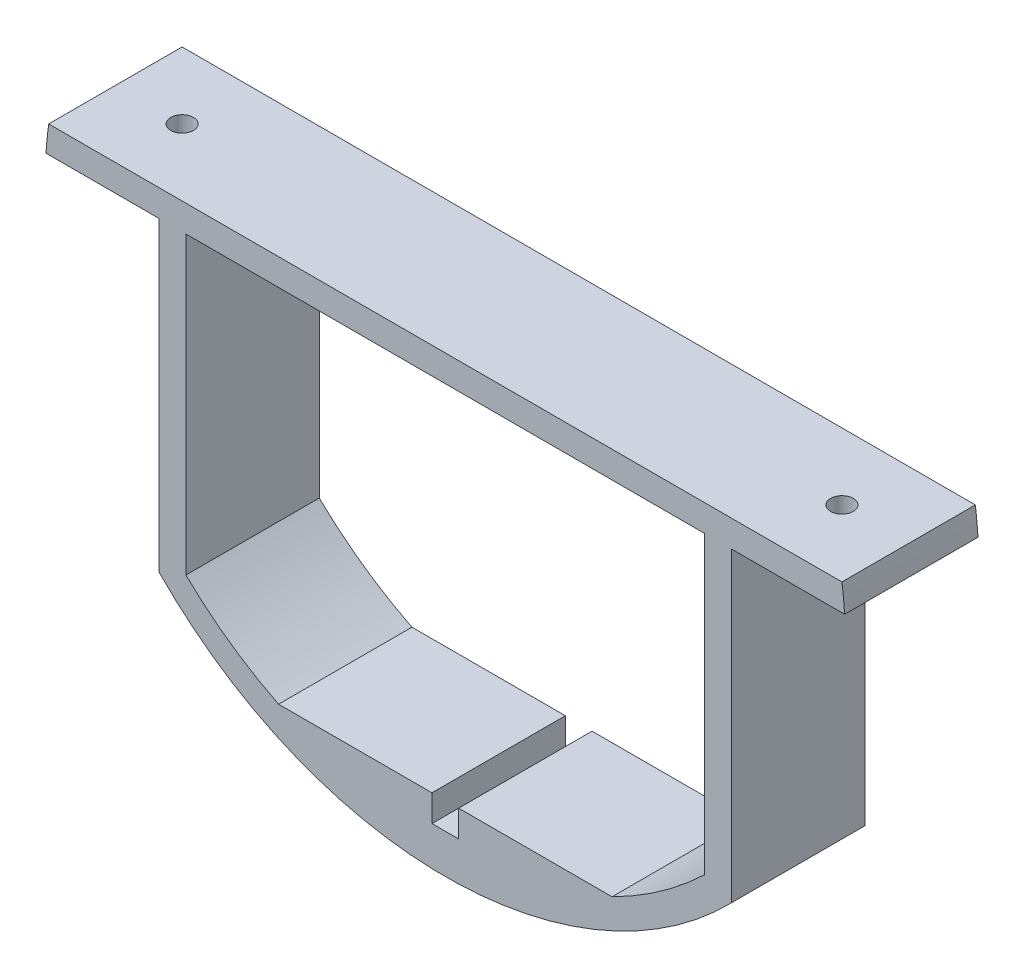
ISO-10303-21;
HEADER;
FILE_DESCRIPTION(('STEP AP214'),'2;1');
FILE_NAME('part.step','',(''),(''),'','','');
FILE_SCHEMA(('AUTOMOTIVE_DESIGN { 1 0 10303 214 1 1 1 1 }'));
ENDSEC;
DATA;
#1=APPLICATION_CONTEXT('core data for automotive mechanical design processes');
#2=APPLICATION_PROTOCOL_DEFINITION('international standard','automotive_design',2000,#1);
#3=PRODUCT_CONTEXT('',#1,'mechanical');
#4=PRODUCT('Part','Part','',(#3));
#5=PRODUCT_RELATED_PRODUCT_CATEGORY('part','',(#4));
#6=PRODUCT_DEFINITION_FORMATION('','',#4);
#7=PRODUCT_DEFINITION_CONTEXT('part definition',#1,'design');
#8=PRODUCT_DEFINITION('design','',#6,#7);
#9=PRODUCT_DEFINITION_SHAPE('','',#8);
#10=(LENGTH_UNIT() NAMED_UNIT(*) SI_UNIT(.MILLI.,.METRE.));
#11=(NAMED_UNIT(*) PLANE_ANGLE_UNIT() SI_UNIT($,.RADIAN.));
#12=(NAMED_UNIT(*) SI_UNIT($,.STERADIAN.) SOLID_ANGLE_UNIT());
#13=UNCERTAINTY_MEASURE_WITH_UNIT(LENGTH_MEASURE(1.E-05),#10,'distance_accuracy_value','');
#14=(GEOMETRIC_REPRESENTATION_CONTEXT(3) GLOBAL_UNCERTAINTY_ASSIGNED_CONTEXT((#13)) GLOBAL_UNIT_ASSIGNED_CONTEXT((#10,
#11,#12)) REPRESENTATION_CONTEXT('',''));
#15=CARTESIAN_POINT('',(0.,0.,0.));
#16=DIRECTION('',(0.,0.,1.));
#17=DIRECTION('',(1.,0.,0.));
#18=AXIS2_PLACEMENT_3D('',#15,#16,#17);
#19=CARTESIAN_POINT('',(0.,0.,25.4));
#20=DIRECTION('',(0.,0.,-1.));
#21=DIRECTION('',(-1.,0.,0.));
#22=AXIS2_PLACEMENT_3D('',#19,#20,#21);
#23=CYLINDRICAL_SURFACE('',#22,76.2);
#24=CARTESIAN_POINT('',(0.,0.,0.));
#25=DIRECTION('',(0.,0.,1.));
#26=DIRECTION('',(1.,0.,0.));
#27=AXIS2_PLACEMENT_3D('',#24,#25,#26);
#28=CIRCLE('',#27,76.2);
#29=CARTESIAN_POINT('',(-75.519629236378,10.16,0.));
#30=VERTEX_POINT('',#29);
#31=CARTESIAN_POINT('',(-76.0304780992465,5.08,0.));
#32=VERTEX_POINT('',#31);
#33=EDGE_CURVE('E179',#30,#32,#28,.T.);
#34=ORIENTED_EDGE('',*,*,#33,.T.);
#35=DIRECTION('',(0.,0.,1.));
#36=VECTOR('',#35,1.);
#37=CARTESIAN_POINT('',(-76.0304780992465,5.08,0.));
#38=LINE('',#37,#36);
#39=CARTESIAN_POINT('',(-76.0304780992465,5.08,25.4));
#40=VERTEX_POINT('',#39);
#41=EDGE_CURVE('E163',#32,#40,#38,.T.);
#42=ORIENTED_EDGE('',*,*,#41,.T.);
#43=CARTESIAN_POINT('',(0.,0.,25.4));
#44=DIRECTION('',(0.,0.,1.));
#45=DIRECTION('',(1.,0.,0.));
#46=AXIS2_PLACEMENT_3D('',#43,#44,#45);
#47=CIRCLE('',#46,76.2);
#48=CARTESIAN_POINT('',(-75.519629236378,10.16,25.4));
#49=VERTEX_POINT('',#48);
#50=EDGE_CURVE('E191',#49,#40,#47,.T.);
#51=ORIENTED_EDGE('',*,*,#50,.F.);
#52=DIRECTION('',(0.,0.,1.));
#53=VECTOR('',#52,1.);
#54=CARTESIAN_POINT('',(-75.519629236378,10.16,-50.8));
#55=LINE('',#54,#53);
#56=EDGE_CURVE('E184',#30,#49,#55,.T.);
#57=ORIENTED_EDGE('',*,*,#56,.F.);
#58=EDGE_LOOP('',(#34,#42,#51,#57));
#59=FACE_BOUND('',#58,.T.);
#60=ADVANCED_FACE('F38',(#59),#23,.T.);
#61=CARTESIAN_POINT('',(-54.4769308973991,-53.2794894870438,25.4));
#62=VERTEX_POINT('',#61);
#63=CARTESIAN_POINT('',(54.4769308973991,-53.2794894870438,25.4));
#64=VERTEX_POINT('',#63);
#65=EDGE_CURVE('E189',#62,#64,#47,.T.);
#66=ORIENTED_EDGE('',*,*,#65,.F.);
#67=DIRECTION('',(0.,0.,1.));
#68=VECTOR('',#67,1.);
#69=CARTESIAN_POINT('',(-54.4769308973991,-53.2794894870438,0.));
#70=LINE('',#69,#68);
#71=CARTESIAN_POINT('',(-54.4769308973991,-53.2794894870438,0.));
#72=VERTEX_POINT('',#71);
#73=EDGE_CURVE('E171',#72,#62,#70,.T.);
#74=ORIENTED_EDGE('',*,*,#73,.F.);
#75=CARTESIAN_POINT('',(54.4769308973991,-53.2794894870438,0.));
#76=VERTEX_POINT('',#75);
#77=EDGE_CURVE('E186',#72,#76,#28,.T.);
#78=ORIENTED_EDGE('',*,*,#77,.T.);
#79=DIRECTION('',(0.,0.,1.));
#80=VECTOR('',#79,1.);
#81=CARTESIAN_POINT('',(54.4769308973991,-53.2794894870438,0.));
#82=LINE('',#81,#80);
#83=EDGE_CURVE('E223',#76,#64,#82,.T.);
#84=ORIENTED_EDGE('',*,*,#83,.T.);
#85=EDGE_LOOP('',(#66,#74,#78,#84));
#86=FACE_BOUND('',#85,.T.);
#87=ADVANCED_FACE('F222',(#86),#23,.T.);
#88=CARTESIAN_POINT('',(0.,-63.6395466671472,-50.8));
#89=DIRECTION('',(0.,-1.,0.));
#90=DIRECTION('',(0.,0.,-1.));
#91=AXIS2_PLACEMENT_3D('',#88,#89,#90);
#92=PLANE('',#91);
#93=DIRECTION('',(1.,0.,0.));
#94=VECTOR('',#93,1.);
#95=CARTESIAN_POINT('',(0.,-63.6395466671472,25.4));
#96=LINE('',#95,#94);
#97=CARTESIAN_POINT('',(-31.75,-63.6395466671472,25.4));
#98=VERTEX_POINT('',#97);
#99=CARTESIAN_POINT('',(-2.54,-63.6395466671472,25.4));
#100=VERTEX_POINT('',#99);
#101=EDGE_CURVE('E266',#98,#100,#96,.T.);
#102=ORIENTED_EDGE('',*,*,#101,.T.);
#103=DIRECTION('',(0.,0.,-1.));
#104=VECTOR('',#103,1.);
#105=CARTESIAN_POINT('',(-2.54,-63.6395466671472,-50.8));
#106=LINE('',#105,#104);
#107=CARTESIAN_POINT('',(-2.54,-63.6395466671472,0.));
#108=VERTEX_POINT('',#107);
#109=EDGE_CURVE('E47',#100,#108,#106,.T.);
#110=ORIENTED_EDGE('',*,*,#109,.T.);
#111=DIRECTION('',(1.,0.,0.));
#112=VECTOR('',#111,1.);
#113=CARTESIAN_POINT('',(0.,-63.6395466671472,0.));
#114=LINE('',#113,#112);
#115=CARTESIAN_POINT('',(-31.75,-63.6395466671472,0.));
#116=VERTEX_POINT('',#115);
#117=EDGE_CURVE('E303',#116,#108,#114,.T.);
#118=ORIENTED_EDGE('',*,*,#117,.F.);
#119=DIRECTION('',(0.,0.,1.));
#120=VECTOR('',#119,1.);
#121=CARTESIAN_POINT('',(-31.75,-63.6395466671472,-50.8));
#122=LINE('',#121,#120);
#123=EDGE_CURVE('E285',#116,#98,#122,.T.);
#124=ORIENTED_EDGE('',*,*,#123,.T.);
#125=EDGE_LOOP('',(#102,#110,#118,#124));
#126=FACE_BOUND('',#125,.T.);
#127=ADVANCED_FACE('F300',(#126),#92,.F.);
#128=CARTESIAN_POINT('',(76.0304780992465,5.08000000000001,25.4));
#129=VERTEX_POINT('',#128);
#130=CARTESIAN_POINT('',(75.519629236378,10.16,25.4));
#131=VERTEX_POINT('',#130);
#132=EDGE_CURVE('E185',#129,#131,#47,.T.);
#133=ORIENTED_EDGE('',*,*,#132,.F.);
#134=DIRECTION('',(0.,0.,1.));
#135=VECTOR('',#134,1.);
#136=CARTESIAN_POINT('',(76.0304780992465,5.08000000000001,0.));
#137=LINE('',#136,#135);
#138=CARTESIAN_POINT('',(76.0304780992465,5.08000000000001,0.));
#139=VERTEX_POINT('',#138);
#140=EDGE_CURVE('E226',#139,#129,#137,.T.);
#141=ORIENTED_EDGE('',*,*,#140,.F.);
#142=CARTESIAN_POINT('',(75.519629236378,10.16,0.));
#143=VERTEX_POINT('',#142);
#144=EDGE_CURVE('E188',#139,#143,#28,.T.);
#145=ORIENTED_EDGE('',*,*,#144,.T.);
#146=DIRECTION('',(0.,0.,1.));
#147=VECTOR('',#146,1.);
#148=CARTESIAN_POINT('',(75.519629236378,10.16,-50.8));
#149=LINE('',#148,#147);
#150=EDGE_CURVE('E194',#143,#131,#149,.T.);
#151=ORIENTED_EDGE('',*,*,#150,.T.);
#152=EDGE_LOOP('',(#133,#141,#145,#151));
#153=FACE_BOUND('',#152,.T.);
#154=ADVANCED_FACE('F40',(#153),#23,.T.);
#155=CARTESIAN_POINT('',(0.,0.,25.4));
#156=DIRECTION('',(0.,0.,1.));
#157=DIRECTION('',(1.,0.,0.));
#158=AXIS2_PLACEMENT_3D('',#155,#156,#157);
#159=PLANE('',#158);
#160=DIRECTION('',(-1.,0.,0.));
#161=VECTOR('',#160,1.);
#162=CARTESIAN_POINT('',(-54.4769308973991,5.08000000000001,25.4));
#163=LINE('',#162,#161);
#164=CARTESIAN_POINT('',(-54.4769308973991,5.08000000000001,25.4));
#165=VERTEX_POINT('',#164);
#166=EDGE_CURVE('E166',#165,#40,#163,.T.);
#167=ORIENTED_EDGE('',*,*,#166,.F.);
#168=DIRECTION('',(0.,1.,0.));
#169=VECTOR('',#168,1.);
#170=CARTESIAN_POINT('',(-54.4769308973991,5.08000000000001,25.4));
#171=LINE('',#170,#169);
#172=EDGE_CURVE('E181',#62,#165,#171,.T.);
#173=ORIENTED_EDGE('',*,*,#172,.F.);
#174=ORIENTED_EDGE('',*,*,#65,.T.);
#175=DIRECTION('',(0.,-1.,0.));
#176=VECTOR('',#175,1.);
#177=CARTESIAN_POINT('',(54.4769308973991,5.08000000000001,25.4));
#178=LINE('',#177,#176);
#179=CARTESIAN_POINT('',(54.4769308973991,5.08000000000001,25.4));
#180=VERTEX_POINT('',#179);
#181=EDGE_CURVE('E217',#180,#64,#178,.T.);
#182=ORIENTED_EDGE('',*,*,#181,.F.);
#183=DIRECTION('',(-1.,0.,0.));
#184=VECTOR('',#183,1.);
#185=CARTESIAN_POINT('',(54.4769308973991,5.08000000000001,25.4));
#186=LINE('',#185,#184);
#187=EDGE_CURVE('E233',#129,#180,#186,.T.);
#188=ORIENTED_EDGE('',*,*,#187,.F.);
#189=ORIENTED_EDGE('',*,*,#132,.T.);
#190=DIRECTION('',(1.,0.,0.));
#191=VECTOR('',#190,1.);
#192=CARTESIAN_POINT('',(-75.519629236378,10.16,25.4));
#193=LINE('',#192,#191);
#194=EDGE_CURVE('E202',#49,#131,#193,.T.);
#195=ORIENTED_EDGE('',*,*,#194,.F.);
#196=ORIENTED_EDGE('',*,*,#50,.T.);
#197=EDGE_LOOP('',(#167,#173,#174,#182,#188,#189,#195,#196));
#198=FACE_BOUND('',#197,.T.);
#199=DIRECTION('',(0.,-1.,0.));
#200=VECTOR('',#199,1.);
#201=CARTESIAN_POINT('',(-2.54,-63.6395466671472,25.4));
#202=LINE('',#201,#200);
#203=CARTESIAN_POINT('',(-2.54,-68.7195466671472,25.4));
#204=VERTEX_POINT('',#203);
#205=EDGE_CURVE('E240',#100,#204,#202,.T.);
#206=ORIENTED_EDGE('',*,*,#205,.F.);
#207=ORIENTED_EDGE('',*,*,#101,.F.);
#208=CARTESIAN_POINT('',(0.,0.,25.4));
#209=DIRECTION('',(0.,0.,1.));
#210=DIRECTION('',(1.,0.,0.));
#211=AXIS2_PLACEMENT_3D('',#208,#209,#210);
#212=CIRCLE('',#211,71.12);
#213=CARTESIAN_POINT('',(-49.3969308973991,-51.1663719440569,25.4));
#214=VERTEX_POINT('',#213);
#215=EDGE_CURVE('E261',#214,#98,#212,.T.);
#216=ORIENTED_EDGE('',*,*,#215,.F.);
#217=DIRECTION('',(0.,-1.,0.));
#218=VECTOR('',#217,1.);
#219=CARTESIAN_POINT('',(-49.3969308973991,0.,25.4));
#220=LINE('',#219,#218);
#221=CARTESIAN_POINT('',(-49.3969308973991,5.08000000000001,25.4));
#222=VERTEX_POINT('',#221);
#223=EDGE_CURVE('E259',#222,#214,#220,.T.);
#224=ORIENTED_EDGE('',*,*,#223,.F.);
#225=DIRECTION('',(1.,0.,0.));
#226=VECTOR('',#225,1.);
#227=CARTESIAN_POINT('',(0.,5.08000000000001,25.4));
#228=LINE('',#227,#226);
#229=CARTESIAN_POINT('',(49.3969308973991,5.08000000000001,25.4));
#230=VERTEX_POINT('',#229);
#231=EDGE_CURVE('E272',#222,#230,#228,.T.);
#232=ORIENTED_EDGE('',*,*,#231,.T.);
#233=DIRECTION('',(0.,-1.,0.));
#234=VECTOR('',#233,1.);
#235=CARTESIAN_POINT('',(49.3969308973991,0.,25.4));
#236=LINE('',#235,#234);
#237=CARTESIAN_POINT('',(49.3969308973991,-51.1663719440569,25.4));
#238=VERTEX_POINT('',#237);
#239=EDGE_CURVE('E269',#230,#238,#236,.T.);
#240=ORIENTED_EDGE('',*,*,#239,.T.);
#241=CARTESIAN_POINT('',(31.75,-63.6395466671472,25.4));
#242=VERTEX_POINT('',#241);
#243=EDGE_CURVE('E265',#242,#238,#212,.T.);
#244=ORIENTED_EDGE('',*,*,#243,.F.);
#245=CARTESIAN_POINT('',(2.54,-63.6395466671472,25.4));
#246=VERTEX_POINT('',#245);
#247=EDGE_CURVE('E264',#246,#242,#96,.T.);
#248=ORIENTED_EDGE('',*,*,#247,.F.);
#249=DIRECTION('',(0.,1.,0.));
#250=VECTOR('',#249,1.);
#251=CARTESIAN_POINT('',(2.54,-63.6395466671472,25.4));
#252=LINE('',#251,#250);
#253=CARTESIAN_POINT('',(2.54,-68.7195466671472,25.4));
#254=VERTEX_POINT('',#253);
#255=EDGE_CURVE('E247',#254,#246,#252,.T.);
#256=ORIENTED_EDGE('',*,*,#255,.F.);
#257=DIRECTION('',(1.,0.,0.));
#258=VECTOR('',#257,1.);
#259=CARTESIAN_POINT('',(-2.54,-68.7195466671472,25.4));
#260=LINE('',#259,#258);
#261=EDGE_CURVE('E243',#204,#254,#260,.T.);
#262=ORIENTED_EDGE('',*,*,#261,.F.);
#263=EDGE_LOOP('',(#206,#207,#216,#224,#232,#240,#244,#248,#256,#262));
#264=FACE_BOUND('',#263,.T.);
#265=ADVANCED_FACE('F214',(#198,#264),#159,.T.);
#266=CARTESIAN_POINT('',(0.,0.,0.));
#267=DIRECTION('',(0.,0.,1.));
#268=DIRECTION('',(1.,0.,0.));
#269=AXIS2_PLACEMENT_3D('',#266,#267,#268);
#270=PLANE('',#269);
#271=ORIENTED_EDGE('',*,*,#117,.T.);
#272=DIRECTION('',(0.,-1.,0.));
#273=VECTOR('',#272,1.);
#274=CARTESIAN_POINT('',(-2.54000000000001,0.,0.));
#275=LINE('',#274,#273);
#276=CARTESIAN_POINT('',(-2.54,-68.7195466671472,0.));
#277=VERTEX_POINT('',#276);
#278=EDGE_CURVE('E256',#108,#277,#275,.T.);
#279=ORIENTED_EDGE('',*,*,#278,.T.);
#280=DIRECTION('',(1.,0.,0.));
#281=VECTOR('',#280,1.);
#282=CARTESIAN_POINT('',(0.,-68.7195466671472,0.));
#283=LINE('',#282,#281);
#284=CARTESIAN_POINT('',(2.54,-68.7195466671472,0.));
#285=VERTEX_POINT('',#284);
#286=EDGE_CURVE('E11',#277,#285,#283,.T.);
#287=ORIENTED_EDGE('',*,*,#286,.T.);
#288=DIRECTION('',(0.,1.,0.));
#289=VECTOR('',#288,1.);
#290=CARTESIAN_POINT('',(2.54,0.,0.));
#291=LINE('',#290,#289);
#292=CARTESIAN_POINT('',(2.54,-63.6395466671472,0.));
#293=VERTEX_POINT('',#292);
#294=EDGE_CURVE('E252',#285,#293,#291,.T.);
#295=ORIENTED_EDGE('',*,*,#294,.T.);
#296=CARTESIAN_POINT('',(31.75,-63.6395466671472,0.));
#297=VERTEX_POINT('',#296);
#298=EDGE_CURVE('E306',#293,#297,#114,.T.);
#299=ORIENTED_EDGE('',*,*,#298,.T.);
#300=CARTESIAN_POINT('',(0.,0.,0.));
#301=DIRECTION('',(0.,0.,1.));
#302=DIRECTION('',(1.,0.,0.));
#303=AXIS2_PLACEMENT_3D('',#300,#301,#302);
#304=CIRCLE('',#303,71.12);
#305=CARTESIAN_POINT('',(49.3969308973991,-51.1663719440569,0.));
#306=VERTEX_POINT('',#305);
#307=EDGE_CURVE('E305',#297,#306,#304,.T.);
#308=ORIENTED_EDGE('',*,*,#307,.T.);
#309=DIRECTION('',(0.,-1.,0.));
#310=VECTOR('',#309,1.);
#311=CARTESIAN_POINT('',(49.3969308973991,0.,0.));
#312=LINE('',#311,#310);
#313=CARTESIAN_POINT('',(49.3969308973991,5.08000000000001,0.));
#314=VERTEX_POINT('',#313);
#315=EDGE_CURVE('E314',#314,#306,#312,.T.);
#316=ORIENTED_EDGE('',*,*,#315,.F.);
#317=DIRECTION('',(1.,0.,0.));
#318=VECTOR('',#317,1.);
#319=CARTESIAN_POINT('',(0.,5.08000000000001,0.));
#320=LINE('',#319,#318);
#321=CARTESIAN_POINT('',(-49.3969308973991,5.08000000000001,0.));
#322=VERTEX_POINT('',#321);
#323=EDGE_CURVE('E316',#322,#314,#320,.T.);
#324=ORIENTED_EDGE('',*,*,#323,.F.);
#325=DIRECTION('',(0.,-1.,0.));
#326=VECTOR('',#325,1.);
#327=CARTESIAN_POINT('',(-49.3969308973991,0.,0.));
#328=LINE('',#327,#326);
#329=CARTESIAN_POINT('',(-49.3969308973991,-51.1663719440569,0.));
#330=VERTEX_POINT('',#329);
#331=EDGE_CURVE('E309',#322,#330,#328,.T.);
#332=ORIENTED_EDGE('',*,*,#331,.T.);
#333=CARTESIAN_POINT('',(0.,0.,0.));
#334=DIRECTION('',(0.,0.,1.));
#335=DIRECTION('',(1.,0.,0.));
#336=AXIS2_PLACEMENT_3D('',#333,#334,#335);
#337=CIRCLE('',#336,71.12);
#338=EDGE_CURVE('E209',#330,#116,#337,.T.);
#339=ORIENTED_EDGE('',*,*,#338,.T.);
#340=EDGE_LOOP('',(#271,#279,#287,#295,#299,#308,#316,#324,#332,#339));
#341=FACE_BOUND('',#340,.T.);
#342=DIRECTION('',(0.,1.,0.));
#343=VECTOR('',#342,1.);
#344=CARTESIAN_POINT('',(-54.4769308973991,5.08000000000001,0.));
#345=LINE('',#344,#343);
#346=CARTESIAN_POINT('',(-54.4769308973991,5.08000000000001,0.));
#347=VERTEX_POINT('',#346);
#348=EDGE_CURVE('E172',#72,#347,#345,.T.);
#349=ORIENTED_EDGE('',*,*,#348,.T.);
#350=DIRECTION('',(-1.,0.,0.));
#351=VECTOR('',#350,1.);
#352=CARTESIAN_POINT('',(-54.4769308973991,5.08000000000001,0.));
#353=LINE('',#352,#351);
#354=EDGE_CURVE('E55',#347,#32,#353,.T.);
#355=ORIENTED_EDGE('',*,*,#354,.T.);
#356=ORIENTED_EDGE('',*,*,#33,.F.);
#357=DIRECTION('',(1.,0.,0.));
#358=VECTOR('',#357,1.);
#359=CARTESIAN_POINT('',(0.,10.16,0.));
#360=LINE('',#359,#358);
#361=EDGE_CURVE('E206',#30,#143,#360,.T.);
#362=ORIENTED_EDGE('',*,*,#361,.T.);
#363=ORIENTED_EDGE('',*,*,#144,.F.);
#364=DIRECTION('',(-1.,0.,0.));
#365=VECTOR('',#364,1.);
#366=CARTESIAN_POINT('',(54.4769308973991,5.08000000000001,0.));
#367=LINE('',#366,#365);
#368=CARTESIAN_POINT('',(54.4769308973991,5.08000000000001,0.));
#369=VERTEX_POINT('',#368);
#370=EDGE_CURVE('E234',#139,#369,#367,.T.);
#371=ORIENTED_EDGE('',*,*,#370,.T.);
#372=DIRECTION('',(0.,-1.,0.));
#373=VECTOR('',#372,1.);
#374=CARTESIAN_POINT('',(54.4769308973991,5.08000000000001,0.));
#375=LINE('',#374,#373);
#376=EDGE_CURVE('E63',#369,#76,#375,.T.);
#377=ORIENTED_EDGE('',*,*,#376,.T.);
#378=ORIENTED_EDGE('',*,*,#77,.F.);
#379=EDGE_LOOP('',(#349,#355,#356,#362,#363,#371,#377,#378));
#380=FACE_BOUND('',#379,.T.);
#381=ADVANCED_FACE('F177',(#341,#380),#270,.F.);
#382=CARTESIAN_POINT('',(-75.519629236378,10.16,-50.8));
#383=DIRECTION('',(0.,-1.,0.));
#384=DIRECTION('',(0.,0.,-1.));
#385=AXIS2_PLACEMENT_3D('',#382,#383,#384);
#386=PLANE('',#385);
#387=CARTESIAN_POINT('',(62.819629236378,10.16,12.7));
#388=DIRECTION('',(0.,1.,0.));
#389=DIRECTION('',(0.,0.,1.));
#390=AXIS2_PLACEMENT_3D('',#387,#388,#389);
#391=CIRCLE('',#390,2.15899999999999);
#392=CARTESIAN_POINT('',(62.819629236378,10.16,14.859));
#393=VERTEX_POINT('',#392);
#394=EDGE_CURVE('E323',#393,#393,#391,.T.);
#395=ORIENTED_EDGE('',*,*,#394,.F.);
#396=EDGE_LOOP('',(#395));
#397=FACE_BOUND('',#396,.T.);
#398=CARTESIAN_POINT('',(-62.819629236378,10.16,12.7));
#399=DIRECTION('',(0.,1.,0.));
#400=DIRECTION('',(0.,0.,1.));
#401=AXIS2_PLACEMENT_3D('',#398,#399,#400);
#402=CIRCLE('',#401,2.15899999999999);
#403=CARTESIAN_POINT('',(-62.819629236378,10.16,14.859));
#404=VERTEX_POINT('',#403);
#405=EDGE_CURVE('E327',#404,#404,#402,.T.);
#406=ORIENTED_EDGE('',*,*,#405,.F.);
#407=EDGE_LOOP('',(#406));
#408=FACE_BOUND('',#407,.T.);
#409=ORIENTED_EDGE('',*,*,#56,.T.);
#410=ORIENTED_EDGE('',*,*,#194,.T.);
#411=ORIENTED_EDGE('',*,*,#150,.F.);
#412=ORIENTED_EDGE('',*,*,#361,.F.);
#413=EDGE_LOOP('',(#409,#410,#411,#412));
#414=FACE_BOUND('',#413,.T.);
#415=ADVANCED_FACE('F507',(#397,#408,#414),#386,.F.);
#416=CARTESIAN_POINT('',(-49.3969308973991,0.,-50.8));
#417=DIRECTION('',(-1.,0.,0.));
#418=DIRECTION('',(0.,-1.,0.));
#419=AXIS2_PLACEMENT_3D('',#416,#417,#418);
#420=PLANE('',#419);
#421=DIRECTION('',(0.,0.,1.));
#422=VECTOR('',#421,1.);
#423=CARTESIAN_POINT('',(-49.3969308973991,5.08000000000001,-50.8));
#424=LINE('',#423,#422);
#425=EDGE_CURVE('E276',#322,#222,#424,.T.);
#426=ORIENTED_EDGE('',*,*,#425,.T.);
#427=ORIENTED_EDGE('',*,*,#223,.T.);
#428=DIRECTION('',(0.,0.,1.));
#429=VECTOR('',#428,1.);
#430=CARTESIAN_POINT('',(-49.3969308973991,-51.1663719440569,-50.8));
#431=LINE('',#430,#429);
#432=EDGE_CURVE('E275',#330,#214,#431,.T.);
#433=ORIENTED_EDGE('',*,*,#432,.F.);
#434=ORIENTED_EDGE('',*,*,#331,.F.);
#435=EDGE_LOOP('',(#426,#427,#433,#434));
#436=FACE_BOUND('',#435,.T.);
#437=ADVANCED_FACE('F498',(#436),#420,.F.);
#438=CARTESIAN_POINT('',(0.,5.08000000000001,-50.8));
#439=DIRECTION('',(0.,-1.,0.));
#440=DIRECTION('',(0.,0.,-1.));
#441=AXIS2_PLACEMENT_3D('',#438,#439,#440);
#442=PLANE('',#441);
#443=ORIENTED_EDGE('',*,*,#323,.T.);
#444=DIRECTION('',(0.,0.,1.));
#445=VECTOR('',#444,1.);
#446=CARTESIAN_POINT('',(49.3969308973991,5.08000000000001,-50.8));
#447=LINE('',#446,#445);
#448=EDGE_CURVE('E278',#314,#230,#447,.T.);
#449=ORIENTED_EDGE('',*,*,#448,.T.);
#450=ORIENTED_EDGE('',*,*,#231,.F.);
#451=ORIENTED_EDGE('',*,*,#425,.F.);
#452=EDGE_LOOP('',(#443,#449,#450,#451));
#453=FACE_BOUND('',#452,.T.);
#454=ADVANCED_FACE('F494',(#453),#442,.T.);
#455=CARTESIAN_POINT('',(49.3969308973991,0.,-50.8));
#456=DIRECTION('',(-1.,0.,0.));
#457=DIRECTION('',(0.,-1.,0.));
#458=AXIS2_PLACEMENT_3D('',#455,#456,#457);
#459=PLANE('',#458);
#460=ORIENTED_EDGE('',*,*,#315,.T.);
#461=DIRECTION('',(0.,0.,1.));
#462=VECTOR('',#461,1.);
#463=CARTESIAN_POINT('',(49.3969308973991,-51.1663719440569,-50.8));
#464=LINE('',#463,#462);
#465=EDGE_CURVE('E280',#306,#238,#464,.T.);
#466=ORIENTED_EDGE('',*,*,#465,.T.);
#467=ORIENTED_EDGE('',*,*,#239,.F.);
#468=ORIENTED_EDGE('',*,*,#448,.F.);
#469=EDGE_LOOP('',(#460,#466,#467,#468));
#470=FACE_BOUND('',#469,.T.);
#471=ADVANCED_FACE('F497',(#470),#459,.T.);
#472=CARTESIAN_POINT('',(0.,0.,-50.8));
#473=DIRECTION('',(0.,0.,1.));
#474=DIRECTION('',(1.,0.,0.));
#475=AXIS2_PLACEMENT_3D('',#472,#473,#474);
#476=CYLINDRICAL_SURFACE('',#475,71.12);
#477=DIRECTION('',(0.,0.,1.));
#478=VECTOR('',#477,1.);
#479=CARTESIAN_POINT('',(31.75,-63.6395466671472,-50.8));
#480=LINE('',#479,#478);
#481=EDGE_CURVE('E282',#297,#242,#480,.T.);
#482=ORIENTED_EDGE('',*,*,#481,.T.);
#483=ORIENTED_EDGE('',*,*,#243,.T.);
#484=ORIENTED_EDGE('',*,*,#465,.F.);
#485=ORIENTED_EDGE('',*,*,#307,.F.);
#486=EDGE_LOOP('',(#482,#483,#484,#485));
#487=FACE_BOUND('',#486,.T.);
#488=ADVANCED_FACE('F375',(#487),#476,.F.);
#489=ORIENTED_EDGE('',*,*,#298,.F.);
#490=DIRECTION('',(0.,0.,1.));
#491=VECTOR('',#490,1.);
#492=CARTESIAN_POINT('',(2.54,-63.6395466671472,-50.8));
#493=LINE('',#492,#491);
#494=EDGE_CURVE('E319',#293,#246,#493,.T.);
#495=ORIENTED_EDGE('',*,*,#494,.T.);
#496=ORIENTED_EDGE('',*,*,#247,.T.);
#497=ORIENTED_EDGE('',*,*,#481,.F.);
#498=EDGE_LOOP('',(#489,#495,#496,#497));
#499=FACE_BOUND('',#498,.T.);
#500=ADVANCED_FACE('F348',(#499),#92,.F.);
#501=ORIENTED_EDGE('',*,*,#432,.T.);
#502=ORIENTED_EDGE('',*,*,#215,.T.);
#503=ORIENTED_EDGE('',*,*,#123,.F.);
#504=ORIENTED_EDGE('',*,*,#338,.F.);
#505=EDGE_LOOP('',(#501,#502,#503,#504));
#506=FACE_BOUND('',#505,.T.);
#507=ADVANCED_FACE('F290',(#506),#476,.F.);
#508=CARTESIAN_POINT('',(-2.54,-68.7195466671472,-25.4));
#509=DIRECTION('',(0.,-1.,0.));
#510=DIRECTION('',(0.,0.,-1.));
#511=AXIS2_PLACEMENT_3D('',#508,#509,#510);
#512=PLANE('',#511);
#513=DIRECTION('',(0.,0.,1.));
#514=VECTOR('',#513,1.);
#515=CARTESIAN_POINT('',(-2.54,-68.7195466671472,-25.4));
#516=LINE('',#515,#514);
#517=EDGE_CURVE('E249',#277,#204,#516,.T.);
#518=ORIENTED_EDGE('',*,*,#517,.T.);
#519=ORIENTED_EDGE('',*,*,#261,.T.);
#520=DIRECTION('',(0.,0.,1.));
#521=VECTOR('',#520,1.);
#522=CARTESIAN_POINT('',(2.54,-68.7195466671472,-25.4));
#523=LINE('',#522,#521);
#524=EDGE_CURVE('E250',#285,#254,#523,.T.);
#525=ORIENTED_EDGE('',*,*,#524,.F.);
#526=ORIENTED_EDGE('',*,*,#286,.F.);
#527=EDGE_LOOP('',(#518,#519,#525,#526));
#528=FACE_BOUND('',#527,.T.);
#529=ADVANCED_FACE('F383',(#528),#512,.F.);
#530=CARTESIAN_POINT('',(-2.54,-63.6395466671472,-25.4));
#531=DIRECTION('',(-1.,0.,0.));
#532=DIRECTION('',(0.,-1.,0.));
#533=AXIS2_PLACEMENT_3D('',#530,#531,#532);
#534=PLANE('',#533);
#535=ORIENTED_EDGE('',*,*,#109,.F.);
#536=ORIENTED_EDGE('',*,*,#205,.T.);
#537=ORIENTED_EDGE('',*,*,#517,.F.);
#538=ORIENTED_EDGE('',*,*,#278,.F.);
#539=EDGE_LOOP('',(#535,#536,#537,#538));
#540=FACE_BOUND('',#539,.T.);
#541=ADVANCED_FACE('F388',(#540),#534,.F.);
#542=CARTESIAN_POINT('',(2.54,-63.6395466671472,-25.4));
#543=DIRECTION('',(1.,0.,0.));
#544=DIRECTION('',(0.,1.,0.));
#545=AXIS2_PLACEMENT_3D('',#542,#543,#544);
#546=PLANE('',#545);
#547=ORIENTED_EDGE('',*,*,#524,.T.);
#548=ORIENTED_EDGE('',*,*,#255,.T.);
#549=ORIENTED_EDGE('',*,*,#494,.F.);
#550=ORIENTED_EDGE('',*,*,#294,.F.);
#551=EDGE_LOOP('',(#547,#548,#549,#550));
#552=FACE_BOUND('',#551,.T.);
#553=ADVANCED_FACE('F398',(#552),#546,.F.);
#554=CARTESIAN_POINT('',(54.4769308973991,5.08000000000001,0.));
#555=DIRECTION('',(-1.,0.,0.));
#556=DIRECTION('',(0.,0.,1.));
#557=AXIS2_PLACEMENT_3D('',#554,#555,#556);
#558=PLANE('',#557);
#559=ORIENTED_EDGE('',*,*,#181,.T.);
#560=ORIENTED_EDGE('',*,*,#83,.F.);
#561=ORIENTED_EDGE('',*,*,#376,.F.);
#562=DIRECTION('',(0.,0.,1.));
#563=VECTOR('',#562,1.);
#564=CARTESIAN_POINT('',(54.4769308973991,5.08000000000001,0.));
#565=LINE('',#564,#563);
#566=EDGE_CURVE('E224',#369,#180,#565,.T.);
#567=ORIENTED_EDGE('',*,*,#566,.T.);
#568=EDGE_LOOP('',(#559,#560,#561,#567));
#569=FACE_BOUND('',#568,.T.);
#570=ADVANCED_FACE('F408',(#569),#558,.F.);
#571=CARTESIAN_POINT('',(54.4769308973991,5.08000000000001,0.));
#572=DIRECTION('',(0.,1.,0.));
#573=DIRECTION('',(0.,0.,1.));
#574=AXIS2_PLACEMENT_3D('',#571,#572,#573);
#575=PLANE('',#574);
#576=CARTESIAN_POINT('',(62.819629236378,5.08000000000001,12.7));
#577=DIRECTION('',(0.,1.,0.));
#578=DIRECTION('',(0.,0.,1.));
#579=AXIS2_PLACEMENT_3D('',#576,#577,#578);
#580=CIRCLE('',#579,2.15899999999999);
#581=CARTESIAN_POINT('',(62.819629236378,5.08000000000001,14.859));
#582=VERTEX_POINT('',#581);
#583=EDGE_CURVE('E42',#582,#582,#580,.T.);
#584=ORIENTED_EDGE('',*,*,#583,.T.);
#585=EDGE_LOOP('',(#584));
#586=FACE_BOUND('',#585,.T.);
#587=ORIENTED_EDGE('',*,*,#187,.T.);
#588=ORIENTED_EDGE('',*,*,#566,.F.);
#589=ORIENTED_EDGE('',*,*,#370,.F.);
#590=ORIENTED_EDGE('',*,*,#140,.T.);
#591=EDGE_LOOP('',(#587,#588,#589,#590));
#592=FACE_BOUND('',#591,.T.);
#593=ADVANCED_FACE('F339',(#586,#592),#575,.F.);
#594=CARTESIAN_POINT('',(-54.4769308973991,5.08000000000001,0.));
#595=DIRECTION('',(0.,1.,0.));
#596=DIRECTION('',(0.,0.,1.));
#597=AXIS2_PLACEMENT_3D('',#594,#595,#596);
#598=PLANE('',#597);
#599=CARTESIAN_POINT('',(-62.819629236378,5.08000000000001,12.7));
#600=DIRECTION('',(0.,1.,0.));
#601=DIRECTION('',(0.,0.,1.));
#602=AXIS2_PLACEMENT_3D('',#599,#600,#601);
#603=CIRCLE('',#602,2.15899999999999);
#604=CARTESIAN_POINT('',(-62.819629236378,5.08000000000001,14.859));
#605=VERTEX_POINT('',#604);
#606=EDGE_CURVE('E229',#605,#605,#603,.T.);
#607=ORIENTED_EDGE('',*,*,#606,.T.);
#608=EDGE_LOOP('',(#607));
#609=FACE_BOUND('',#608,.T.);
#610=ORIENTED_EDGE('',*,*,#166,.T.);
#611=ORIENTED_EDGE('',*,*,#41,.F.);
#612=ORIENTED_EDGE('',*,*,#354,.F.);
#613=DIRECTION('',(0.,0.,1.));
#614=VECTOR('',#613,1.);
#615=CARTESIAN_POINT('',(-54.4769308973991,5.08000000000001,0.));
#616=LINE('',#615,#614);
#617=EDGE_CURVE('E244',#347,#165,#616,.T.);
#618=ORIENTED_EDGE('',*,*,#617,.T.);
#619=EDGE_LOOP('',(#610,#611,#612,#618));
#620=FACE_BOUND('',#619,.T.);
#621=ADVANCED_FACE('F164',(#609,#620),#598,.F.);
#622=CARTESIAN_POINT('',(-54.4769308973991,5.08000000000001,0.));
#623=DIRECTION('',(1.,0.,0.));
#624=DIRECTION('',(0.,1.,0.));
#625=AXIS2_PLACEMENT_3D('',#622,#623,#624);
#626=PLANE('',#625);
#627=ORIENTED_EDGE('',*,*,#172,.T.);
#628=ORIENTED_EDGE('',*,*,#617,.F.);
#629=ORIENTED_EDGE('',*,*,#348,.F.);
#630=ORIENTED_EDGE('',*,*,#73,.T.);
#631=EDGE_LOOP('',(#627,#628,#629,#630));
#632=FACE_BOUND('',#631,.T.);
#633=ADVANCED_FACE('F453',(#632),#626,.F.);
#634=CARTESIAN_POINT('',(-62.819629236378,-15.24,12.7));
#635=DIRECTION('',(0.,1.,0.));
#636=DIRECTION('',(0.,0.,1.));
#637=AXIS2_PLACEMENT_3D('',#634,#635,#636);
#638=CYLINDRICAL_SURFACE('',#637,2.15899999999999);
#639=ORIENTED_EDGE('',*,*,#405,.T.);
#640=EDGE_LOOP('',(#639));
#641=FACE_BOUND('',#640,.T.);
#642=ORIENTED_EDGE('',*,*,#606,.F.);
#643=EDGE_LOOP('',(#642));
#644=FACE_BOUND('',#643,.T.);
#645=ADVANCED_FACE('F463',(#641,#644),#638,.F.);
#646=CARTESIAN_POINT('',(62.819629236378,-15.24,12.7));
#647=DIRECTION('',(0.,1.,0.));
#648=DIRECTION('',(0.,0.,1.));
#649=AXIS2_PLACEMENT_3D('',#646,#647,#648);
#650=CYLINDRICAL_SURFACE('',#649,2.15899999999999);
#651=ORIENTED_EDGE('',*,*,#394,.T.);
#652=EDGE_LOOP('',(#651));
#653=FACE_BOUND('',#652,.T.);
#654=ORIENTED_EDGE('',*,*,#583,.F.);
#655=EDGE_LOOP('',(#654));
#656=FACE_BOUND('',#655,.T.);
#657=ADVANCED_FACE('F473',(#653,#656),#650,.F.);
#658=CLOSED_SHELL('',(#60,#87,#127,#154,#265,#381,#415,#437,#454,#471,#488,#500,#507,#529,#541,
#553,#570,#593,#621,#633,#645,#657));
#659=MANIFOLD_SOLID_BREP('B2',#658);
#660=ADVANCED_BREP_SHAPE_REPRESENTATION('',(#18,#659),#14);
#661=SHAPE_DEFINITION_REPRESENTATION(#9,#660);
ENDSEC;
END-ISO-10303-21;
